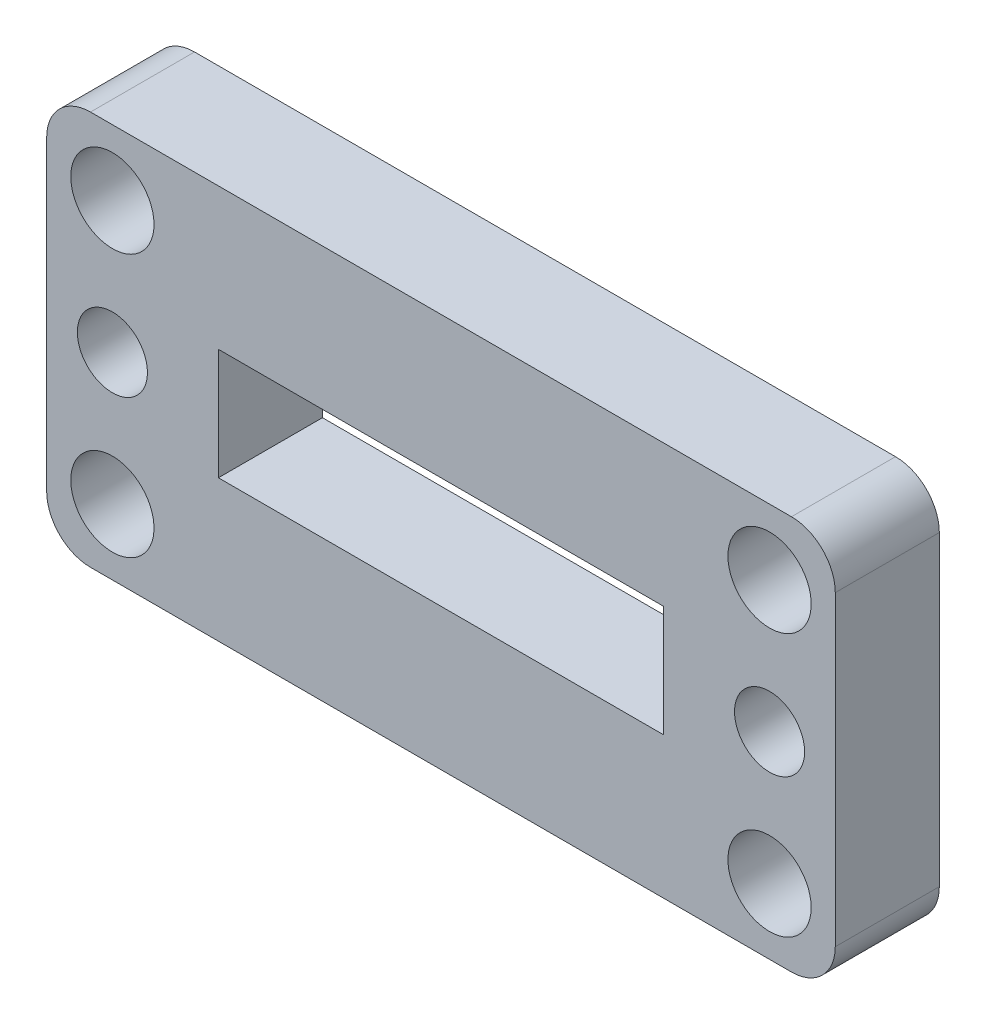
ISO-10303-21;
HEADER;
FILE_DESCRIPTION(('STEP AP214'),'2;1');
FILE_NAME('part.step','',(''),(''),'','','');
FILE_SCHEMA(('AUTOMOTIVE_DESIGN { 1 0 10303 214 1 1 1 1 }'));
ENDSEC;
DATA;
#1=APPLICATION_CONTEXT('core data for automotive mechanical design processes');
#2=APPLICATION_PROTOCOL_DEFINITION('international standard','automotive_design',2000,#1);
#3=PRODUCT_CONTEXT('',#1,'mechanical');
#4=PRODUCT('Part','Part','',(#3));
#5=PRODUCT_RELATED_PRODUCT_CATEGORY('part','',(#4));
#6=PRODUCT_DEFINITION_FORMATION('','',#4);
#7=PRODUCT_DEFINITION_CONTEXT('part definition',#1,'design');
#8=PRODUCT_DEFINITION('design','',#6,#7);
#9=PRODUCT_DEFINITION_SHAPE('','',#8);
#10=(LENGTH_UNIT() NAMED_UNIT(*) SI_UNIT(.MILLI.,.METRE.));
#11=(NAMED_UNIT(*) PLANE_ANGLE_UNIT() SI_UNIT($,.RADIAN.));
#12=(NAMED_UNIT(*) SI_UNIT($,.STERADIAN.) SOLID_ANGLE_UNIT());
#13=UNCERTAINTY_MEASURE_WITH_UNIT(LENGTH_MEASURE(1.E-05),#10,'distance_accuracy_value','');
#14=(GEOMETRIC_REPRESENTATION_CONTEXT(3) GLOBAL_UNCERTAINTY_ASSIGNED_CONTEXT((#13)) GLOBAL_UNIT_ASSIGNED_CONTEXT((#10,
#11,#12)) REPRESENTATION_CONTEXT('',''));
#15=CARTESIAN_POINT('',(0.,0.,0.));
#16=DIRECTION('',(0.,0.,1.));
#17=DIRECTION('',(1.,0.,0.));
#18=AXIS2_PLACEMENT_3D('',#15,#16,#17);
#19=CARTESIAN_POINT('',(16.,7.,4.75));
#20=DIRECTION('',(0.,0.,1.));
#21=DIRECTION('',(1.,0.,0.));
#22=AXIS2_PLACEMENT_3D('',#19,#20,#21);
#23=PLANE('',#22);
#24=CARTESIAN_POINT('',(-14.9999999999864,3.40474063403179E-12,4.75));
#25=DIRECTION('',(0.,0.,1.));
#26=DIRECTION('',(1.,0.,0.));
#27=AXIS2_PLACEMENT_3D('',#24,#25,#26);
#28=CIRCLE('',#27,1.59999999999901);
#29=CARTESIAN_POINT('',(-13.3999999999873,3.40474063403179E-12,4.75));
#30=VERTEX_POINT('',#29);
#31=EDGE_CURVE('E379',#30,#30,#28,.T.);
#32=ORIENTED_EDGE('',*,*,#31,.F.);
#33=EDGE_LOOP('',(#32));
#34=FACE_BOUND('',#33,.T.);
#35=DIRECTION('',(-1.,0.,0.));
#36=VECTOR('',#35,1.);
#37=CARTESIAN_POINT('',(10.16,2.53999999999999,4.75));
#38=LINE('',#37,#36);
#39=CARTESIAN_POINT('',(10.16,2.53999999999999,4.75));
#40=VERTEX_POINT('',#39);
#41=CARTESIAN_POINT('',(-10.16,2.54,4.75));
#42=VERTEX_POINT('',#41);
#43=EDGE_CURVE('E152',#40,#42,#38,.T.);
#44=ORIENTED_EDGE('',*,*,#43,.F.);
#45=DIRECTION('',(0.,1.,0.));
#46=VECTOR('',#45,1.);
#47=CARTESIAN_POINT('',(10.16,-2.54,4.75));
#48=LINE('',#47,#46);
#49=CARTESIAN_POINT('',(10.16,-2.54,4.75));
#50=VERTEX_POINT('',#49);
#51=EDGE_CURVE('E143',#50,#40,#48,.T.);
#52=ORIENTED_EDGE('',*,*,#51,.F.);
#53=DIRECTION('',(1.,0.,0.));
#54=VECTOR('',#53,1.);
#55=CARTESIAN_POINT('',(10.16,-2.54,4.75));
#56=LINE('',#55,#54);
#57=CARTESIAN_POINT('',(-10.16,-2.54,4.75));
#58=VERTEX_POINT('',#57);
#59=EDGE_CURVE('E171',#58,#50,#56,.T.);
#60=ORIENTED_EDGE('',*,*,#59,.F.);
#61=DIRECTION('',(0.,-1.,0.));
#62=VECTOR('',#61,1.);
#63=CARTESIAN_POINT('',(-10.16,-2.54,4.75));
#64=LINE('',#63,#62);
#65=EDGE_CURVE('E166',#42,#58,#64,.T.);
#66=ORIENTED_EDGE('',*,*,#65,.F.);
#67=EDGE_LOOP('',(#44,#52,#60,#66));
#68=FACE_BOUND('',#67,.T.);
#69=CARTESIAN_POINT('',(-15.,-5.99999999999998,4.75));
#70=DIRECTION('',(0.,0.,1.));
#71=DIRECTION('',(-1.,0.,0.));
#72=AXIS2_PLACEMENT_3D('',#69,#70,#71);
#73=CIRCLE('',#72,1.9);
#74=CARTESIAN_POINT('',(-16.9,-5.99999999999998,4.75));
#75=VERTEX_POINT('',#74);
#76=EDGE_CURVE('E201',#75,#75,#73,.T.);
#77=ORIENTED_EDGE('',*,*,#76,.F.);
#78=EDGE_LOOP('',(#77));
#79=FACE_BOUND('',#78,.T.);
#80=CARTESIAN_POINT('',(16.,7.,4.75));
#81=DIRECTION('',(0.,0.,1.));
#82=DIRECTION('',(1.,0.,0.));
#83=AXIS2_PLACEMENT_3D('',#80,#81,#82);
#84=CIRCLE('',#83,2.);
#85=CARTESIAN_POINT('',(18.,7.,4.75));
#86=VERTEX_POINT('',#85);
#87=CARTESIAN_POINT('',(16.,9.,4.75));
#88=VERTEX_POINT('',#87);
#89=EDGE_CURVE('E216',#86,#88,#84,.T.);
#90=ORIENTED_EDGE('',*,*,#89,.T.);
#91=DIRECTION('',(-1.,0.,0.));
#92=VECTOR('',#91,1.);
#93=CARTESIAN_POINT('',(16.,9.,4.75));
#94=LINE('',#93,#92);
#95=CARTESIAN_POINT('',(-16.,8.99999999999999,4.75));
#96=VERTEX_POINT('',#95);
#97=EDGE_CURVE('E219',#88,#96,#94,.T.);
#98=ORIENTED_EDGE('',*,*,#97,.T.);
#99=CARTESIAN_POINT('',(-16.,7.,4.75));
#100=DIRECTION('',(0.,0.,1.));
#101=DIRECTION('',(1.,0.,0.));
#102=AXIS2_PLACEMENT_3D('',#99,#100,#101);
#103=CIRCLE('',#102,2.);
#104=CARTESIAN_POINT('',(-18.,7.,4.75));
#105=VERTEX_POINT('',#104);
#106=EDGE_CURVE('E223',#96,#105,#103,.T.);
#107=ORIENTED_EDGE('',*,*,#106,.T.);
#108=DIRECTION('',(0.,-1.,0.));
#109=VECTOR('',#108,1.);
#110=CARTESIAN_POINT('',(-18.,-7.,4.75));
#111=LINE('',#110,#109);
#112=CARTESIAN_POINT('',(-18.,-7.,4.75));
#113=VERTEX_POINT('',#112);
#114=EDGE_CURVE('E226',#105,#113,#111,.T.);
#115=ORIENTED_EDGE('',*,*,#114,.T.);
#116=CARTESIAN_POINT('',(-16.,-7.,4.75));
#117=DIRECTION('',(0.,0.,1.));
#118=DIRECTION('',(1.,0.,0.));
#119=AXIS2_PLACEMENT_3D('',#116,#117,#118);
#120=CIRCLE('',#119,2.);
#121=CARTESIAN_POINT('',(-16.,-9.,4.75));
#122=VERTEX_POINT('',#121);
#123=EDGE_CURVE('E229',#113,#122,#120,.T.);
#124=ORIENTED_EDGE('',*,*,#123,.T.);
#125=DIRECTION('',(1.,0.,0.));
#126=VECTOR('',#125,1.);
#127=CARTESIAN_POINT('',(16.,-9.,4.75));
#128=LINE('',#127,#126);
#129=CARTESIAN_POINT('',(16.,-9.,4.75));
#130=VERTEX_POINT('',#129);
#131=EDGE_CURVE('E231',#122,#130,#128,.T.);
#132=ORIENTED_EDGE('',*,*,#131,.T.);
#133=CARTESIAN_POINT('',(16.,-7.,4.75));
#134=DIRECTION('',(0.,0.,1.));
#135=DIRECTION('',(1.,0.,0.));
#136=AXIS2_PLACEMENT_3D('',#133,#134,#135);
#137=CIRCLE('',#136,2.);
#138=CARTESIAN_POINT('',(18.,-7.,4.75));
#139=VERTEX_POINT('',#138);
#140=EDGE_CURVE('E234',#130,#139,#137,.T.);
#141=ORIENTED_EDGE('',*,*,#140,.T.);
#142=DIRECTION('',(0.,1.,0.));
#143=VECTOR('',#142,1.);
#144=CARTESIAN_POINT('',(18.,-7.,4.75));
#145=LINE('',#144,#143);
#146=EDGE_CURVE('E236',#139,#86,#145,.T.);
#147=ORIENTED_EDGE('',*,*,#146,.T.);
#148=EDGE_LOOP('',(#90,#98,#107,#115,#124,#132,#141,#147));
#149=FACE_BOUND('',#148,.T.);
#150=CARTESIAN_POINT('',(15.,6.,4.75));
#151=DIRECTION('',(0.,0.,1.));
#152=DIRECTION('',(-1.,0.,0.));
#153=AXIS2_PLACEMENT_3D('',#150,#151,#152);
#154=CIRCLE('',#153,1.9);
#155=CARTESIAN_POINT('',(13.1,6.,4.75));
#156=VERTEX_POINT('',#155);
#157=EDGE_CURVE('E208',#156,#156,#154,.T.);
#158=ORIENTED_EDGE('',*,*,#157,.F.);
#159=EDGE_LOOP('',(#158));
#160=FACE_BOUND('',#159,.T.);
#161=CARTESIAN_POINT('',(15.,-5.99999999999998,4.75));
#162=DIRECTION('',(0.,0.,1.));
#163=DIRECTION('',(1.,0.,0.));
#164=AXIS2_PLACEMENT_3D('',#161,#162,#163);
#165=CIRCLE('',#164,1.9);
#166=CARTESIAN_POINT('',(16.9,-5.99999999999998,4.75));
#167=VERTEX_POINT('',#166);
#168=EDGE_CURVE('E194',#167,#167,#165,.T.);
#169=ORIENTED_EDGE('',*,*,#168,.F.);
#170=EDGE_LOOP('',(#169));
#171=FACE_BOUND('',#170,.T.);
#172=CARTESIAN_POINT('',(-15.,6.,4.75));
#173=DIRECTION('',(0.,0.,1.));
#174=DIRECTION('',(1.,0.,0.));
#175=AXIS2_PLACEMENT_3D('',#172,#173,#174);
#176=CIRCLE('',#175,1.9);
#177=CARTESIAN_POINT('',(-13.1,6.,4.75));
#178=VERTEX_POINT('',#177);
#179=EDGE_CURVE('E179',#178,#178,#176,.T.);
#180=ORIENTED_EDGE('',*,*,#179,.F.);
#181=EDGE_LOOP('',(#180));
#182=FACE_BOUND('',#181,.T.);
#183=CARTESIAN_POINT('',(14.9999999999864,3.40841457442923E-12,4.75));
#184=DIRECTION('',(0.,0.,1.));
#185=DIRECTION('',(1.,0.,0.));
#186=AXIS2_PLACEMENT_3D('',#183,#184,#185);
#187=CIRCLE('',#186,1.599999999999);
#188=CARTESIAN_POINT('',(16.5999999999854,3.40841457442923E-12,4.75));
#189=VERTEX_POINT('',#188);
#190=EDGE_CURVE('E373',#189,#189,#187,.T.);
#191=ORIENTED_EDGE('',*,*,#190,.F.);
#192=EDGE_LOOP('',(#191));
#193=FACE_BOUND('',#192,.T.);
#194=ADVANCED_FACE('F39',(#34,#68,#79,#149,#160,#171,#182,#193),#23,.T.);
#195=CARTESIAN_POINT('',(16.,7.,0.));
#196=DIRECTION('',(0.,0.,1.));
#197=DIRECTION('',(1.,0.,0.));
#198=AXIS2_PLACEMENT_3D('',#195,#196,#197);
#199=PLANE('',#198);
#200=CARTESIAN_POINT('',(-14.9999999999864,3.40474063403179E-12,0.));
#201=DIRECTION('',(0.,0.,1.));
#202=DIRECTION('',(1.,0.,0.));
#203=AXIS2_PLACEMENT_3D('',#200,#201,#202);
#204=CIRCLE('',#203,1.59999999999901);
#205=CARTESIAN_POINT('',(-13.3999999999873,3.40474063403179E-12,0.));
#206=VERTEX_POINT('',#205);
#207=EDGE_CURVE('E376',#206,#206,#204,.T.);
#208=ORIENTED_EDGE('',*,*,#207,.T.);
#209=EDGE_LOOP('',(#208));
#210=FACE_BOUND('',#209,.T.);
#211=DIRECTION('',(0.,1.,0.));
#212=VECTOR('',#211,1.);
#213=CARTESIAN_POINT('',(10.16,-2.54,0.));
#214=LINE('',#213,#212);
#215=CARTESIAN_POINT('',(10.16,-2.54,0.));
#216=VERTEX_POINT('',#215);
#217=CARTESIAN_POINT('',(10.16,2.53999999999999,0.));
#218=VERTEX_POINT('',#217);
#219=EDGE_CURVE('E68',#216,#218,#214,.T.);
#220=ORIENTED_EDGE('',*,*,#219,.T.);
#221=DIRECTION('',(-1.,0.,0.));
#222=VECTOR('',#221,1.);
#223=CARTESIAN_POINT('',(10.16,2.53999999999999,0.));
#224=LINE('',#223,#222);
#225=CARTESIAN_POINT('',(-10.16,2.54,0.));
#226=VERTEX_POINT('',#225);
#227=EDGE_CURVE('E159',#218,#226,#224,.T.);
#228=ORIENTED_EDGE('',*,*,#227,.T.);
#229=DIRECTION('',(0.,-1.,0.));
#230=VECTOR('',#229,1.);
#231=CARTESIAN_POINT('',(-10.16,-2.54,0.));
#232=LINE('',#231,#230);
#233=CARTESIAN_POINT('',(-10.16,-2.54,0.));
#234=VERTEX_POINT('',#233);
#235=EDGE_CURVE('E182',#226,#234,#232,.T.);
#236=ORIENTED_EDGE('',*,*,#235,.T.);
#237=DIRECTION('',(1.,0.,0.));
#238=VECTOR('',#237,1.);
#239=CARTESIAN_POINT('',(10.16,-2.54,0.));
#240=LINE('',#239,#238);
#241=EDGE_CURVE('E153',#234,#216,#240,.T.);
#242=ORIENTED_EDGE('',*,*,#241,.T.);
#243=EDGE_LOOP('',(#220,#228,#236,#242));
#244=FACE_BOUND('',#243,.T.);
#245=CARTESIAN_POINT('',(-15.,-5.99999999999998,0.));
#246=DIRECTION('',(0.,0.,1.));
#247=DIRECTION('',(-1.,0.,0.));
#248=AXIS2_PLACEMENT_3D('',#245,#246,#247);
#249=CIRCLE('',#248,1.9);
#250=CARTESIAN_POINT('',(-16.9,-5.99999999999998,0.));
#251=VERTEX_POINT('',#250);
#252=EDGE_CURVE('E197',#251,#251,#249,.T.);
#253=ORIENTED_EDGE('',*,*,#252,.T.);
#254=EDGE_LOOP('',(#253));
#255=FACE_BOUND('',#254,.T.);
#256=CARTESIAN_POINT('',(16.,7.,0.));
#257=DIRECTION('',(0.,0.,1.));
#258=DIRECTION('',(1.,0.,0.));
#259=AXIS2_PLACEMENT_3D('',#256,#257,#258);
#260=CIRCLE('',#259,2.);
#261=CARTESIAN_POINT('',(18.,7.,0.));
#262=VERTEX_POINT('',#261);
#263=CARTESIAN_POINT('',(16.,9.,0.));
#264=VERTEX_POINT('',#263);
#265=EDGE_CURVE('E212',#262,#264,#260,.T.);
#266=ORIENTED_EDGE('',*,*,#265,.F.);
#267=DIRECTION('',(0.,1.,0.));
#268=VECTOR('',#267,1.);
#269=CARTESIAN_POINT('',(18.,-7.,0.));
#270=LINE('',#269,#268);
#271=CARTESIAN_POINT('',(18.,-7.,0.));
#272=VERTEX_POINT('',#271);
#273=EDGE_CURVE('E220',#272,#262,#270,.T.);
#274=ORIENTED_EDGE('',*,*,#273,.F.);
#275=CARTESIAN_POINT('',(16.,-7.,0.));
#276=DIRECTION('',(0.,0.,1.));
#277=DIRECTION('',(1.,0.,0.));
#278=AXIS2_PLACEMENT_3D('',#275,#276,#277);
#279=CIRCLE('',#278,2.);
#280=CARTESIAN_POINT('',(16.,-9.,0.));
#281=VERTEX_POINT('',#280);
#282=EDGE_CURVE('E257',#281,#272,#279,.T.);
#283=ORIENTED_EDGE('',*,*,#282,.F.);
#284=DIRECTION('',(1.,0.,0.));
#285=VECTOR('',#284,1.);
#286=CARTESIAN_POINT('',(16.,-9.,0.));
#287=LINE('',#286,#285);
#288=CARTESIAN_POINT('',(-16.,-9.,0.));
#289=VERTEX_POINT('',#288);
#290=EDGE_CURVE('E254',#289,#281,#287,.T.);
#291=ORIENTED_EDGE('',*,*,#290,.F.);
#292=CARTESIAN_POINT('',(-16.,-7.,0.));
#293=DIRECTION('',(0.,0.,1.));
#294=DIRECTION('',(1.,0.,0.));
#295=AXIS2_PLACEMENT_3D('',#292,#293,#294);
#296=CIRCLE('',#295,2.);
#297=CARTESIAN_POINT('',(-18.,-7.,0.));
#298=VERTEX_POINT('',#297);
#299=EDGE_CURVE('E252',#298,#289,#296,.T.);
#300=ORIENTED_EDGE('',*,*,#299,.F.);
#301=DIRECTION('',(0.,-1.,0.));
#302=VECTOR('',#301,1.);
#303=CARTESIAN_POINT('',(-18.,-7.,0.));
#304=LINE('',#303,#302);
#305=CARTESIAN_POINT('',(-18.,7.,0.));
#306=VERTEX_POINT('',#305);
#307=EDGE_CURVE('E249',#306,#298,#304,.T.);
#308=ORIENTED_EDGE('',*,*,#307,.F.);
#309=CARTESIAN_POINT('',(-16.,7.,0.));
#310=DIRECTION('',(0.,0.,1.));
#311=DIRECTION('',(1.,0.,0.));
#312=AXIS2_PLACEMENT_3D('',#309,#310,#311);
#313=CIRCLE('',#312,2.);
#314=CARTESIAN_POINT('',(-16.,8.99999999999999,0.));
#315=VERTEX_POINT('',#314);
#316=EDGE_CURVE('E246',#315,#306,#313,.T.);
#317=ORIENTED_EDGE('',*,*,#316,.F.);
#318=DIRECTION('',(-1.,0.,0.));
#319=VECTOR('',#318,1.);
#320=CARTESIAN_POINT('',(16.,9.,0.));
#321=LINE('',#320,#319);
#322=EDGE_CURVE('E243',#264,#315,#321,.T.);
#323=ORIENTED_EDGE('',*,*,#322,.F.);
#324=EDGE_LOOP('',(#266,#274,#283,#291,#300,#308,#317,#323));
#325=FACE_BOUND('',#324,.T.);
#326=CARTESIAN_POINT('',(15.,6.,0.));
#327=DIRECTION('',(0.,0.,1.));
#328=DIRECTION('',(-1.,0.,0.));
#329=AXIS2_PLACEMENT_3D('',#326,#327,#328);
#330=CIRCLE('',#329,1.9);
#331=CARTESIAN_POINT('',(13.1,6.,0.));
#332=VERTEX_POINT('',#331);
#333=EDGE_CURVE('E204',#332,#332,#330,.T.);
#334=ORIENTED_EDGE('',*,*,#333,.T.);
#335=EDGE_LOOP('',(#334));
#336=FACE_BOUND('',#335,.T.);
#337=CARTESIAN_POINT('',(15.,-5.99999999999998,0.));
#338=DIRECTION('',(0.,0.,1.));
#339=DIRECTION('',(1.,0.,0.));
#340=AXIS2_PLACEMENT_3D('',#337,#338,#339);
#341=CIRCLE('',#340,1.9);
#342=CARTESIAN_POINT('',(16.9,-5.99999999999998,0.));
#343=VERTEX_POINT('',#342);
#344=EDGE_CURVE('E161',#343,#343,#341,.T.);
#345=ORIENTED_EDGE('',*,*,#344,.T.);
#346=EDGE_LOOP('',(#345));
#347=FACE_BOUND('',#346,.T.);
#348=CARTESIAN_POINT('',(-15.,6.,0.));
#349=DIRECTION('',(0.,0.,1.));
#350=DIRECTION('',(1.,0.,0.));
#351=AXIS2_PLACEMENT_3D('',#348,#349,#350);
#352=CIRCLE('',#351,1.9);
#353=CARTESIAN_POINT('',(-13.1,6.,0.));
#354=VERTEX_POINT('',#353);
#355=EDGE_CURVE('E367',#354,#354,#352,.T.);
#356=ORIENTED_EDGE('',*,*,#355,.T.);
#357=EDGE_LOOP('',(#356));
#358=FACE_BOUND('',#357,.T.);
#359=CARTESIAN_POINT('',(14.9999999999864,3.40841457442923E-12,0.));
#360=DIRECTION('',(0.,0.,1.));
#361=DIRECTION('',(1.,0.,0.));
#362=AXIS2_PLACEMENT_3D('',#359,#360,#361);
#363=CIRCLE('',#362,1.599999999999);
#364=CARTESIAN_POINT('',(16.5999999999854,3.40841457442923E-12,0.));
#365=VERTEX_POINT('',#364);
#366=EDGE_CURVE('E370',#365,#365,#363,.T.);
#367=ORIENTED_EDGE('',*,*,#366,.T.);
#368=EDGE_LOOP('',(#367));
#369=FACE_BOUND('',#368,.T.);
#370=ADVANCED_FACE('F294',(#210,#244,#255,#325,#336,#347,#358,#369),#199,.F.);
#371=CARTESIAN_POINT('',(16.,7.,4.75));
#372=DIRECTION('',(0.,0.,-1.));
#373=DIRECTION('',(-1.,0.,0.));
#374=AXIS2_PLACEMENT_3D('',#371,#372,#373);
#375=CYLINDRICAL_SURFACE('',#374,2.);
#376=ORIENTED_EDGE('',*,*,#265,.T.);
#377=DIRECTION('',(0.,0.,-1.));
#378=VECTOR('',#377,1.);
#379=CARTESIAN_POINT('',(16.,9.,4.75));
#380=LINE('',#379,#378);
#381=EDGE_CURVE('E11',#88,#264,#380,.T.);
#382=ORIENTED_EDGE('',*,*,#381,.F.);
#383=ORIENTED_EDGE('',*,*,#89,.F.);
#384=DIRECTION('',(0.,0.,-1.));
#385=VECTOR('',#384,1.);
#386=CARTESIAN_POINT('',(18.,7.,4.75));
#387=LINE('',#386,#385);
#388=EDGE_CURVE('E239',#86,#262,#387,.T.);
#389=ORIENTED_EDGE('',*,*,#388,.T.);
#390=EDGE_LOOP('',(#376,#382,#383,#389));
#391=FACE_BOUND('',#390,.T.);
#392=ADVANCED_FACE('F41',(#391),#375,.T.);
#393=CARTESIAN_POINT('',(16.,9.,4.75));
#394=DIRECTION('',(0.,-1.,0.));
#395=DIRECTION('',(1.,0.,0.));
#396=AXIS2_PLACEMENT_3D('',#393,#394,#395);
#397=PLANE('',#396);
#398=ORIENTED_EDGE('',*,*,#322,.T.);
#399=DIRECTION('',(0.,0.,-1.));
#400=VECTOR('',#399,1.);
#401=CARTESIAN_POINT('',(-16.,8.99999999999999,4.75));
#402=LINE('',#401,#400);
#403=EDGE_CURVE('E48',#96,#315,#402,.T.);
#404=ORIENTED_EDGE('',*,*,#403,.F.);
#405=ORIENTED_EDGE('',*,*,#97,.F.);
#406=ORIENTED_EDGE('',*,*,#381,.T.);
#407=EDGE_LOOP('',(#398,#404,#405,#406));
#408=FACE_BOUND('',#407,.T.);
#409=ADVANCED_FACE('F312',(#408),#397,.F.);
#410=CARTESIAN_POINT('',(-16.,7.,4.75));
#411=DIRECTION('',(0.,0.,-1.));
#412=DIRECTION('',(-1.,0.,0.));
#413=AXIS2_PLACEMENT_3D('',#410,#411,#412);
#414=CYLINDRICAL_SURFACE('',#413,2.);
#415=ORIENTED_EDGE('',*,*,#316,.T.);
#416=DIRECTION('',(0.,0.,-1.));
#417=VECTOR('',#416,1.);
#418=CARTESIAN_POINT('',(-18.,7.,4.75));
#419=LINE('',#418,#417);
#420=EDGE_CURVE('E278',#105,#306,#419,.T.);
#421=ORIENTED_EDGE('',*,*,#420,.F.);
#422=ORIENTED_EDGE('',*,*,#106,.F.);
#423=ORIENTED_EDGE('',*,*,#403,.T.);
#424=EDGE_LOOP('',(#415,#421,#422,#423));
#425=FACE_BOUND('',#424,.T.);
#426=ADVANCED_FACE('F288',(#425),#414,.T.);
#427=CARTESIAN_POINT('',(-18.,-7.,4.75));
#428=DIRECTION('',(1.,0.,0.));
#429=DIRECTION('',(0.,0.,-1.));
#430=AXIS2_PLACEMENT_3D('',#427,#428,#429);
#431=PLANE('',#430);
#432=ORIENTED_EDGE('',*,*,#307,.T.);
#433=DIRECTION('',(0.,0.,-1.));
#434=VECTOR('',#433,1.);
#435=CARTESIAN_POINT('',(-18.,-7.,4.75));
#436=LINE('',#435,#434);
#437=EDGE_CURVE('E275',#113,#298,#436,.T.);
#438=ORIENTED_EDGE('',*,*,#437,.F.);
#439=ORIENTED_EDGE('',*,*,#114,.F.);
#440=ORIENTED_EDGE('',*,*,#420,.T.);
#441=EDGE_LOOP('',(#432,#438,#439,#440));
#442=FACE_BOUND('',#441,.T.);
#443=ADVANCED_FACE('F300',(#442),#431,.F.);
#444=CARTESIAN_POINT('',(-16.,-7.,4.75));
#445=DIRECTION('',(0.,0.,-1.));
#446=DIRECTION('',(-1.,0.,0.));
#447=AXIS2_PLACEMENT_3D('',#444,#445,#446);
#448=CYLINDRICAL_SURFACE('',#447,2.);
#449=ORIENTED_EDGE('',*,*,#299,.T.);
#450=DIRECTION('',(0.,0.,-1.));
#451=VECTOR('',#450,1.);
#452=CARTESIAN_POINT('',(-16.,-9.,4.75));
#453=LINE('',#452,#451);
#454=EDGE_CURVE('E272',#122,#289,#453,.T.);
#455=ORIENTED_EDGE('',*,*,#454,.F.);
#456=ORIENTED_EDGE('',*,*,#123,.F.);
#457=ORIENTED_EDGE('',*,*,#437,.T.);
#458=EDGE_LOOP('',(#449,#455,#456,#457));
#459=FACE_BOUND('',#458,.T.);
#460=ADVANCED_FACE('F304',(#459),#448,.T.);
#461=CARTESIAN_POINT('',(16.,-9.,4.75));
#462=DIRECTION('',(0.,1.,0.));
#463=DIRECTION('',(0.,0.,1.));
#464=AXIS2_PLACEMENT_3D('',#461,#462,#463);
#465=PLANE('',#464);
#466=ORIENTED_EDGE('',*,*,#290,.T.);
#467=DIRECTION('',(0.,0.,-1.));
#468=VECTOR('',#467,1.);
#469=CARTESIAN_POINT('',(16.,-9.,4.75));
#470=LINE('',#469,#468);
#471=EDGE_CURVE('E268',#130,#281,#470,.T.);
#472=ORIENTED_EDGE('',*,*,#471,.F.);
#473=ORIENTED_EDGE('',*,*,#131,.F.);
#474=ORIENTED_EDGE('',*,*,#454,.T.);
#475=EDGE_LOOP('',(#466,#472,#473,#474));
#476=FACE_BOUND('',#475,.T.);
#477=ADVANCED_FACE('F325',(#476),#465,.F.);
#478=CARTESIAN_POINT('',(16.,-7.,4.75));
#479=DIRECTION('',(0.,0.,-1.));
#480=DIRECTION('',(-1.,0.,0.));
#481=AXIS2_PLACEMENT_3D('',#478,#479,#480);
#482=CYLINDRICAL_SURFACE('',#481,2.);
#483=ORIENTED_EDGE('',*,*,#282,.T.);
#484=DIRECTION('',(0.,0.,-1.));
#485=VECTOR('',#484,1.);
#486=CARTESIAN_POINT('',(18.,-7.,4.75));
#487=LINE('',#486,#485);
#488=EDGE_CURVE('E265',#139,#272,#487,.T.);
#489=ORIENTED_EDGE('',*,*,#488,.F.);
#490=ORIENTED_EDGE('',*,*,#140,.F.);
#491=ORIENTED_EDGE('',*,*,#471,.T.);
#492=EDGE_LOOP('',(#483,#489,#490,#491));
#493=FACE_BOUND('',#492,.T.);
#494=ADVANCED_FACE('F323',(#493),#482,.T.);
#495=CARTESIAN_POINT('',(18.,-7.,4.75));
#496=DIRECTION('',(-1.,0.,0.));
#497=DIRECTION('',(0.,0.,1.));
#498=AXIS2_PLACEMENT_3D('',#495,#496,#497);
#499=PLANE('',#498);
#500=ORIENTED_EDGE('',*,*,#273,.T.);
#501=ORIENTED_EDGE('',*,*,#388,.F.);
#502=ORIENTED_EDGE('',*,*,#146,.F.);
#503=ORIENTED_EDGE('',*,*,#488,.T.);
#504=EDGE_LOOP('',(#500,#501,#502,#503));
#505=FACE_BOUND('',#504,.T.);
#506=ADVANCED_FACE('F318',(#505),#499,.F.);
#507=CARTESIAN_POINT('',(15.,6.,4.75));
#508=DIRECTION('',(0.,0.,-1.));
#509=DIRECTION('',(-1.,0.,0.));
#510=AXIS2_PLACEMENT_3D('',#507,#508,#509);
#511=CYLINDRICAL_SURFACE('',#510,1.9);
#512=ORIENTED_EDGE('',*,*,#157,.T.);
#513=EDGE_LOOP('',(#512));
#514=FACE_BOUND('',#513,.T.);
#515=ORIENTED_EDGE('',*,*,#333,.F.);
#516=EDGE_LOOP('',(#515));
#517=FACE_BOUND('',#516,.T.);
#518=ADVANCED_FACE('F344',(#514,#517),#511,.F.);
#519=CARTESIAN_POINT('',(-15.,-5.99999999999998,4.75));
#520=DIRECTION('',(0.,0.,-1.));
#521=DIRECTION('',(-1.,0.,0.));
#522=AXIS2_PLACEMENT_3D('',#519,#520,#521);
#523=CYLINDRICAL_SURFACE('',#522,1.9);
#524=ORIENTED_EDGE('',*,*,#76,.T.);
#525=EDGE_LOOP('',(#524));
#526=FACE_BOUND('',#525,.T.);
#527=ORIENTED_EDGE('',*,*,#252,.F.);
#528=EDGE_LOOP('',(#527));
#529=FACE_BOUND('',#528,.T.);
#530=ADVANCED_FACE('F351',(#526,#529),#523,.F.);
#531=CARTESIAN_POINT('',(15.,-5.99999999999998,4.75));
#532=DIRECTION('',(0.,0.,-1.));
#533=DIRECTION('',(-1.,0.,0.));
#534=AXIS2_PLACEMENT_3D('',#531,#532,#533);
#535=CYLINDRICAL_SURFACE('',#534,1.9);
#536=ORIENTED_EDGE('',*,*,#168,.T.);
#537=EDGE_LOOP('',(#536));
#538=FACE_BOUND('',#537,.T.);
#539=ORIENTED_EDGE('',*,*,#344,.F.);
#540=EDGE_LOOP('',(#539));
#541=FACE_BOUND('',#540,.T.);
#542=ADVANCED_FACE('F356',(#538,#541),#535,.F.);
#543=CARTESIAN_POINT('',(10.16,-2.54,4.75));
#544=DIRECTION('',(-1.,0.,0.));
#545=DIRECTION('',(0.,0.,1.));
#546=AXIS2_PLACEMENT_3D('',#543,#544,#545);
#547=PLANE('',#546);
#548=ORIENTED_EDGE('',*,*,#219,.F.);
#549=DIRECTION('',(0.,0.,-1.));
#550=VECTOR('',#549,1.);
#551=CARTESIAN_POINT('',(10.16,-2.54,4.75));
#552=LINE('',#551,#550);
#553=EDGE_CURVE('E147',#50,#216,#552,.T.);
#554=ORIENTED_EDGE('',*,*,#553,.F.);
#555=ORIENTED_EDGE('',*,*,#51,.T.);
#556=DIRECTION('',(0.,0.,-1.));
#557=VECTOR('',#556,1.);
#558=CARTESIAN_POINT('',(10.16,2.53999999999999,4.75));
#559=LINE('',#558,#557);
#560=EDGE_CURVE('E146',#40,#218,#559,.T.);
#561=ORIENTED_EDGE('',*,*,#560,.T.);
#562=EDGE_LOOP('',(#548,#554,#555,#561));
#563=FACE_BOUND('',#562,.T.);
#564=ADVANCED_FACE('F145',(#563),#547,.T.);
#565=CARTESIAN_POINT('',(10.16,2.53999999999999,4.75));
#566=DIRECTION('',(0.,-1.,0.));
#567=DIRECTION('',(1.,0.,0.));
#568=AXIS2_PLACEMENT_3D('',#565,#566,#567);
#569=PLANE('',#568);
#570=ORIENTED_EDGE('',*,*,#227,.F.);
#571=ORIENTED_EDGE('',*,*,#560,.F.);
#572=ORIENTED_EDGE('',*,*,#43,.T.);
#573=DIRECTION('',(0.,0.,-1.));
#574=VECTOR('',#573,1.);
#575=CARTESIAN_POINT('',(-10.16,2.54,4.75));
#576=LINE('',#575,#574);
#577=EDGE_CURVE('E162',#42,#226,#576,.T.);
#578=ORIENTED_EDGE('',*,*,#577,.T.);
#579=EDGE_LOOP('',(#570,#571,#572,#578));
#580=FACE_BOUND('',#579,.T.);
#581=ADVANCED_FACE('F156',(#580),#569,.T.);
#582=CARTESIAN_POINT('',(-10.16,-2.54,4.75));
#583=DIRECTION('',(1.,0.,0.));
#584=DIRECTION('',(0.,0.,-1.));
#585=AXIS2_PLACEMENT_3D('',#582,#583,#584);
#586=PLANE('',#585);
#587=ORIENTED_EDGE('',*,*,#235,.F.);
#588=ORIENTED_EDGE('',*,*,#577,.F.);
#589=ORIENTED_EDGE('',*,*,#65,.T.);
#590=DIRECTION('',(0.,0.,-1.));
#591=VECTOR('',#590,1.);
#592=CARTESIAN_POINT('',(-10.16,-2.54,4.75));
#593=LINE('',#592,#591);
#594=EDGE_CURVE('E57',#58,#234,#593,.T.);
#595=ORIENTED_EDGE('',*,*,#594,.T.);
#596=EDGE_LOOP('',(#587,#588,#589,#595));
#597=FACE_BOUND('',#596,.T.);
#598=ADVANCED_FACE('F410',(#597),#586,.T.);
#599=CARTESIAN_POINT('',(10.16,-2.54,4.75));
#600=DIRECTION('',(0.,1.,0.));
#601=DIRECTION('',(-1.,0.,0.));
#602=AXIS2_PLACEMENT_3D('',#599,#600,#601);
#603=PLANE('',#602);
#604=ORIENTED_EDGE('',*,*,#241,.F.);
#605=ORIENTED_EDGE('',*,*,#594,.F.);
#606=ORIENTED_EDGE('',*,*,#59,.T.);
#607=ORIENTED_EDGE('',*,*,#553,.T.);
#608=EDGE_LOOP('',(#604,#605,#606,#607));
#609=FACE_BOUND('',#608,.T.);
#610=ADVANCED_FACE('F407',(#609),#603,.T.);
#611=CARTESIAN_POINT('',(-15.,6.,4.75));
#612=DIRECTION('',(0.,0.,-1.));
#613=DIRECTION('',(-1.,0.,0.));
#614=AXIS2_PLACEMENT_3D('',#611,#612,#613);
#615=CYLINDRICAL_SURFACE('',#614,1.9);
#616=ORIENTED_EDGE('',*,*,#179,.T.);
#617=EDGE_LOOP('',(#616));
#618=FACE_BOUND('',#617,.T.);
#619=ORIENTED_EDGE('',*,*,#355,.F.);
#620=EDGE_LOOP('',(#619));
#621=FACE_BOUND('',#620,.T.);
#622=ADVANCED_FACE('F389',(#618,#621),#615,.F.);
#623=CARTESIAN_POINT('',(-14.9999999999864,3.40474063403179E-12,4.75));
#624=DIRECTION('',(0.,0.,-1.));
#625=DIRECTION('',(-1.,0.,0.));
#626=AXIS2_PLACEMENT_3D('',#623,#624,#625);
#627=CYLINDRICAL_SURFACE('',#626,1.59999999999901);
#628=ORIENTED_EDGE('',*,*,#31,.T.);
#629=EDGE_LOOP('',(#628));
#630=FACE_BOUND('',#629,.T.);
#631=ORIENTED_EDGE('',*,*,#207,.F.);
#632=EDGE_LOOP('',(#631));
#633=FACE_BOUND('',#632,.T.);
#634=ADVANCED_FACE('F397',(#630,#633),#627,.F.);
#635=CARTESIAN_POINT('',(14.9999999999864,3.40841457442923E-12,4.75));
#636=DIRECTION('',(0.,0.,-1.));
#637=DIRECTION('',(-1.,0.,0.));
#638=AXIS2_PLACEMENT_3D('',#635,#636,#637);
#639=CYLINDRICAL_SURFACE('',#638,1.599999999999);
#640=ORIENTED_EDGE('',*,*,#190,.T.);
#641=EDGE_LOOP('',(#640));
#642=FACE_BOUND('',#641,.T.);
#643=ORIENTED_EDGE('',*,*,#366,.F.);
#644=EDGE_LOOP('',(#643));
#645=FACE_BOUND('',#644,.T.);
#646=ADVANCED_FACE('F395',(#642,#645),#639,.F.);
#647=CLOSED_SHELL('',(#194,#370,#392,#409,#426,#443,#460,#477,#494,#506,#518,#530,#542,#564,
#581,#598,#610,#622,#634,#646));
#648=MANIFOLD_SOLID_BREP('B2',#647);
#649=ADVANCED_BREP_SHAPE_REPRESENTATION('',(#18,#648),#14);
#650=SHAPE_DEFINITION_REPRESENTATION(#9,#649);
ENDSEC;
END-ISO-10303-21;
